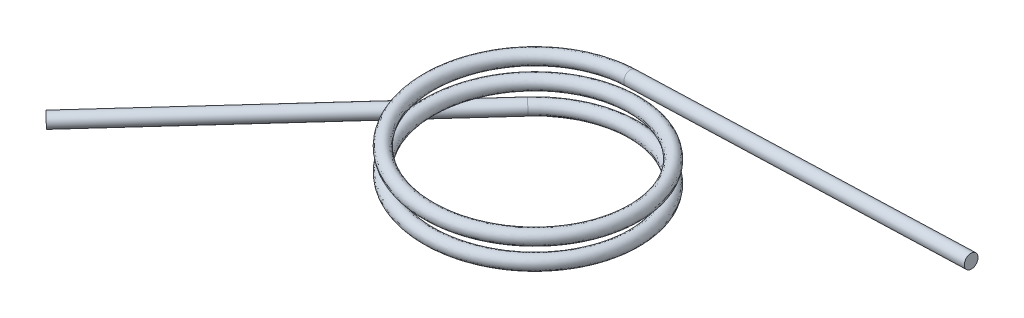
ISO-10303-21;
HEADER;
FILE_DESCRIPTION(('STEP AP214'),'2;1');
FILE_NAME('part.step','',(''),(''),'','','');
FILE_SCHEMA(('AUTOMOTIVE_DESIGN { 1 0 10303 214 1 1 1 1 }'));
ENDSEC;
DATA;
#1=APPLICATION_CONTEXT('core data for automotive mechanical design processes');
#2=APPLICATION_PROTOCOL_DEFINITION('international standard','automotive_design',2000,#1);
#3=PRODUCT_CONTEXT('',#1,'mechanical');
#4=PRODUCT('Part','Part','',(#3));
#5=PRODUCT_RELATED_PRODUCT_CATEGORY('part','',(#4));
#6=PRODUCT_DEFINITION_FORMATION('','',#4);
#7=PRODUCT_DEFINITION_CONTEXT('part definition',#1,'design');
#8=PRODUCT_DEFINITION('design','',#6,#7);
#9=PRODUCT_DEFINITION_SHAPE('','',#8);
#10=(LENGTH_UNIT() NAMED_UNIT(*) SI_UNIT(.MILLI.,.METRE.));
#11=(NAMED_UNIT(*) PLANE_ANGLE_UNIT() SI_UNIT($,.RADIAN.));
#12=(NAMED_UNIT(*) SI_UNIT($,.STERADIAN.) SOLID_ANGLE_UNIT());
#13=UNCERTAINTY_MEASURE_WITH_UNIT(LENGTH_MEASURE(1.E-05),#10,'distance_accuracy_value','');
#14=(GEOMETRIC_REPRESENTATION_CONTEXT(3) GLOBAL_UNCERTAINTY_ASSIGNED_CONTEXT((#13)) GLOBAL_UNIT_ASSIGNED_CONTEXT((#10,
#11,#12)) REPRESENTATION_CONTEXT('',''));
#15=CARTESIAN_POINT('',(0.,0.,0.));
#16=DIRECTION('',(0.,0.,1.));
#17=DIRECTION('',(1.,0.,0.));
#18=AXIS2_PLACEMENT_3D('',#15,#16,#17);
#19=CARTESIAN_POINT('',(0.0683991630659008,-2.03084848142146,-30.607));
#20=CARTESIAN_POINT('',(-6.91744885759342,-2.26216990999289,-30.6226116626235));
#21=CARTESIAN_POINT('',(-13.2182540866581,-2.49349133856432,-27.6056314245129));
#22=CARTESIAN_POINT('',(-19.5190593157229,-2.72481276713575,-24.5886511864022));
#23=CARTESIAN_POINT('',(-23.8868700032717,-2.95613419570717,-19.1366289845496));
#24=CARTESIAN_POINT('',(-28.2546806908206,-3.1874556242786,-13.6846067826971));
#25=CARTESIAN_POINT('',(-29.8243983625018,-3.41877705285003,-6.87738247884374));
#26=CARTESIAN_POINT('',(-31.3941160341831,-3.65009848142146,-0.0701581749904256));
#27=CARTESIAN_POINT('',(-29.8548388537963,-3.88141990999289,6.74401397235809));
#28=CARTESIAN_POINT('',(-28.3155616734096,-4.11274133856432,13.5581861197066));
#29=CARTESIAN_POINT('',(-23.9721623645263,-4.34406276713575,19.0296757464309));
#30=CARTESIAN_POINT('',(-19.6287630556429,-4.57538419570717,24.5011653731551));
#31=CARTESIAN_POINT('',(-13.3415051196841,-4.8067056242786,27.5462768552658));
#32=CARTESIAN_POINT('',(-7.05424718372522,-5.03802705285003,30.5913883373765));
#33=CARTESIAN_POINT('',(-0.0683991630659045,-5.26934848142146,30.607));
#34=CARTESIAN_POINT('',(6.91744885759342,-5.50066990999289,30.6226116626235));
#35=CARTESIAN_POINT('',(13.2182540866581,-5.73199133856432,27.6056314245129));
#36=CARTESIAN_POINT('',(19.5190593157229,-5.96331276713575,24.5886511864022));
#37=CARTESIAN_POINT('',(23.8868700032717,-6.19463419570718,19.1366289845497));
#38=CARTESIAN_POINT('',(28.2546806908206,-6.4259556242786,13.6846067826971));
#39=CARTESIAN_POINT('',(29.8243983625018,-6.65727705285003,6.87738247884374));
#40=CARTESIAN_POINT('',(31.3941160341831,-6.88859848142146,0.0701581749904294));
#41=CARTESIAN_POINT('',(29.8548388537963,-7.11991990999289,-6.74401397235809));
#42=CARTESIAN_POINT('',(28.3155616734096,-7.35124133856432,-13.5581861197066));
#43=CARTESIAN_POINT('',(23.9721623645263,-7.58256276713575,-19.0296757464309));
#44=CARTESIAN_POINT('',(19.6287630556429,-7.81388419570717,-24.5011653731551));
#45=CARTESIAN_POINT('',(13.3415051196841,-8.0452056242786,-27.5462768552658));
#46=CARTESIAN_POINT('',(7.05424718372523,-8.27652705285003,-30.5913883373765));
#47=CARTESIAN_POINT('',(0.0683991630659008,-8.50784848142146,-30.607));
#48=CARTESIAN_POINT('',(-6.91744885759342,-8.73916990999289,-30.6226116626235));
#49=CARTESIAN_POINT('',(-13.2182540866581,-8.97049133856432,-27.6056314245129));
#50=CARTESIAN_POINT('',(-19.5190593157229,-9.20181276713575,-24.5886511864022));
#51=CARTESIAN_POINT('',(-23.8868700032717,-9.43313419570718,-19.1366289845496));
#52=CARTESIAN_POINT('',(-28.2546806908206,-9.6644556242786,-13.6846067826971));
#53=CARTESIAN_POINT('',(-29.8243983625018,-9.89577705285003,-6.87738247884374));
#54=CARTESIAN_POINT('',(-31.3941160341831,-10.1270984814215,-0.0701581749904256));
#55=CARTESIAN_POINT('',(-29.8548388537963,-10.3584199099929,6.74401397235809));
#56=CARTESIAN_POINT('',(-28.3155616734096,-10.5897413385643,13.5581861197066));
#57=CARTESIAN_POINT('',(-23.9721623645263,-10.8210627671357,19.0296757464309));
#58=CARTESIAN_POINT('',(-19.6287630556429,-11.0523841957072,24.5011653731551));
#59=CARTESIAN_POINT('',(-13.3415051196841,-11.2837056242786,27.5462768552658));
#60=CARTESIAN_POINT('',(-7.05424718372522,-11.51502705285,30.5913883373765));
#61=CARTESIAN_POINT('',(-0.0683991630659045,-11.7463484814215,30.607));
#62=CARTESIAN_POINT('',(6.91744885759342,-11.9776699099929,30.6226116626235));
#63=CARTESIAN_POINT('',(13.2182540866581,-12.2089913385643,27.6056314245129));
#64=CARTESIAN_POINT('',(19.5190593157229,-12.4403127671357,24.5886511864022));
#65=CARTESIAN_POINT('',(23.8868700032717,-12.6716341957072,19.1366289845497));
#66=CARTESIAN_POINT('',(28.2546806908206,-12.9029556242786,13.6846067826971));
#67=CARTESIAN_POINT('',(29.8243983625018,-13.13427705285,6.87738247884374));
#68=CARTESIAN_POINT('',(31.3941160341831,-13.3655984814215,0.0701581749904294));
#69=CARTESIAN_POINT('',(29.8548388537963,-13.5969199099929,-6.74401397235809));
#70=CARTESIAN_POINT('',(28.3155616734096,-13.8282413385643,-13.5581861197066));
#71=CARTESIAN_POINT('',(23.9721623645263,-14.0595627671357,-19.0296757464309));
#72=CARTESIAN_POINT('',(19.6287630556429,-14.2908841957072,-24.5011653731551));
#73=CARTESIAN_POINT('',(13.3415051196841,-14.5222056242786,-27.5462768552658));
#74=CARTESIAN_POINT('',(7.05424718372523,-14.75352705285,-30.5913883373765));
#75=CARTESIAN_POINT('',(0.0683991630659008,-14.9848484814215,-30.607));
#76=CARTESIAN_POINT('',(-6.91744885759342,-15.2161699099929,-30.6226116626235));
#77=CARTESIAN_POINT('',(-13.2182540866581,-15.4474913385643,-27.6056314245129));
#78=CARTESIAN_POINT('',(-17.9086280696568,-15.6196890134387,-25.3597652055763));
#79=CARTESIAN_POINT('',(-21.5940342546356,-15.7952045007292,-21.6908001709281));
#80=CARTESIAN_POINT('',(0.0683991630659331,-2.03084848142146,-26.543));
#81=CARTESIAN_POINT('',(-5.98986737767182,-2.26216990999289,-26.5586116626236));
#82=CARTESIAN_POINT('',(-11.4549505708844,-2.49349133856432,-23.9440939453575));
#83=CARTESIAN_POINT('',(-16.9200337640969,-2.72481276713574,-21.3295762280914));
#84=CARTESIAN_POINT('',(-20.7095068585216,-2.95613419570717,-16.6027664297958));
#85=CARTESIAN_POINT('',(-24.4989799529464,-3.1874556242786,-11.8759566315002));
#86=CARTESIAN_POINT('',(-25.8622913273949,-3.41877705285003,-5.97305740324531));
#87=CARTESIAN_POINT('',(-27.2256027018434,-3.65009848142146,-0.0701581749904585));
#88=CARTESIAN_POINT('',(-25.8927318186894,-3.88141990999289,5.8396888967596));
#89=CARTESIAN_POINT('',(-24.5598609355354,-4.11274133856432,11.7495359685097));
#90=CARTESIAN_POINT('',(-20.7947992197762,-4.34406276713574,16.495813191677));
#91=CARTESIAN_POINT('',(-17.029737504017,-4.57538419570717,21.2420904148443));
#92=CARTESIAN_POINT('',(-11.5782016039103,-4.8067056242786,23.8847393761104));
#93=CARTESIAN_POINT('',(-6.12666570380369,-5.03802705285003,26.5273883373765));
#94=CARTESIAN_POINT('',(-0.0683991630659364,-5.26934848142146,26.543));
#95=CARTESIAN_POINT('',(5.98986737767181,-5.50066990999289,26.5586116626236));
#96=CARTESIAN_POINT('',(11.4549505708844,-5.73199133856432,23.9440939453575));
#97=CARTESIAN_POINT('',(16.9200337640969,-5.96331276713574,21.3295762280914));
#98=CARTESIAN_POINT('',(20.7095068585216,-6.19463419570717,16.6027664297958));
#99=CARTESIAN_POINT('',(24.4989799529464,-6.4259556242786,11.8759566315002));
#100=CARTESIAN_POINT('',(25.8622913273949,-6.65727705285003,5.97305740324531));
#101=CARTESIAN_POINT('',(27.2256027018434,-6.88859848142146,0.0701581749904618));
#102=CARTESIAN_POINT('',(25.8927318186894,-7.11991990999289,-5.83968889675959));
#103=CARTESIAN_POINT('',(24.5598609355354,-7.35124133856432,-11.7495359685097));
#104=CARTESIAN_POINT('',(20.7947992197762,-7.58256276713575,-16.495813191677));
#105=CARTESIAN_POINT('',(17.029737504017,-7.81388419570717,-21.2420904148443));
#106=CARTESIAN_POINT('',(11.5782016039103,-8.0452056242786,-23.8847393761104));
#107=CARTESIAN_POINT('',(6.12666570380369,-8.27652705285003,-26.5273883373765));
#108=CARTESIAN_POINT('',(0.0683991630659331,-8.50784848142146,-26.543));
#109=CARTESIAN_POINT('',(-5.98986737767182,-8.73916990999289,-26.5586116626236));
#110=CARTESIAN_POINT('',(-11.4549505708844,-8.97049133856432,-23.9440939453575));
#111=CARTESIAN_POINT('',(-16.9200337640969,-9.20181276713574,-21.3295762280914));
#112=CARTESIAN_POINT('',(-20.7095068585216,-9.43313419570717,-16.6027664297958));
#113=CARTESIAN_POINT('',(-24.4989799529464,-9.6644556242786,-11.8759566315002));
#114=CARTESIAN_POINT('',(-25.8622913273949,-9.89577705285003,-5.97305740324531));
#115=CARTESIAN_POINT('',(-27.2256027018434,-10.1270984814215,-0.0701581749904585));
#116=CARTESIAN_POINT('',(-25.8927318186894,-10.3584199099929,5.8396888967596));
#117=CARTESIAN_POINT('',(-24.5598609355354,-10.5897413385643,11.7495359685097));
#118=CARTESIAN_POINT('',(-20.7947992197762,-10.8210627671357,16.495813191677));
#119=CARTESIAN_POINT('',(-17.029737504017,-11.0523841957072,21.2420904148443));
#120=CARTESIAN_POINT('',(-11.5782016039103,-11.2837056242786,23.8847393761104));
#121=CARTESIAN_POINT('',(-6.12666570380369,-11.51502705285,26.5273883373765));
#122=CARTESIAN_POINT('',(-0.0683991630659364,-11.7463484814215,26.543));
#123=CARTESIAN_POINT('',(5.98986737767181,-11.9776699099929,26.5586116626236));
#124=CARTESIAN_POINT('',(11.4549505708844,-12.2089913385643,23.9440939453575));
#125=CARTESIAN_POINT('',(16.9200337640969,-12.4403127671357,21.3295762280914));
#126=CARTESIAN_POINT('',(20.7095068585216,-12.6716341957072,16.6027664297958));
#127=CARTESIAN_POINT('',(24.4989799529464,-12.9029556242786,11.8759566315002));
#128=CARTESIAN_POINT('',(25.8622913273949,-13.13427705285,5.97305740324531));
#129=CARTESIAN_POINT('',(27.2256027018434,-13.3655984814215,0.0701581749904618));
#130=CARTESIAN_POINT('',(25.8927318186894,-13.5969199099929,-5.83968889675959));
#131=CARTESIAN_POINT('',(24.5598609355354,-13.8282413385643,-11.7495359685097));
#132=CARTESIAN_POINT('',(20.7947992197762,-14.0595627671357,-16.495813191677));
#133=CARTESIAN_POINT('',(17.029737504017,-14.2908841957072,-21.2420904148443));
#134=CARTESIAN_POINT('',(11.5782016039103,-14.5222056242786,-23.8847393761104));
#135=CARTESIAN_POINT('',(6.12666570380369,-14.75352705285,-26.5273883373765));
#136=CARTESIAN_POINT('',(0.0683991630659331,-14.9848484814215,-26.543));
#137=CARTESIAN_POINT('',(-5.98986737767182,-15.2161699099929,-26.5586116626236));
#138=CARTESIAN_POINT('',(-11.4549505708844,-15.4474913385643,-23.9440939453575));
#139=CARTESIAN_POINT('',(-15.5232058323111,-15.6196890134387,-21.997824312615));
#140=CARTESIAN_POINT('',(-18.720354612391,-15.7952045007292,-18.8171158956903));
#141=CARTESIAN_POINT('',(-0.0683991630662958,2.03084848142146,-26.543));
#142=CARTESIAN_POINT('',(-6.12666570380405,1.79952705285003,-26.5273883373764));
#143=CARTESIAN_POINT('',(-11.5782016039107,1.5682056242786,-23.8847393761102));
#144=CARTESIAN_POINT('',(-17.0297375040173,1.33688419570718,-21.242090414844));
#145=CARTESIAN_POINT('',(-20.7947992197764,1.10556276713575,-16.4958131916767));
#146=CARTESIAN_POINT('',(-24.5598609355356,0.874241338564318,-11.7495359685093));
#147=CARTESIAN_POINT('',(-25.8927318186895,0.64291990999289,-5.83968889675925));
#148=CARTESIAN_POINT('',(-27.2256027018434,0.411598481421461,0.0701581749908272));
#149=CARTESIAN_POINT('',(-25.8622913273948,0.180277052850032,5.97305740324566));
#150=CARTESIAN_POINT('',(-24.4989799529462,-0.0510443757213964,11.8759566315005));
#151=CARTESIAN_POINT('',(-20.7095068585214,-0.282365804292825,16.6027664297961));
#152=CARTESIAN_POINT('',(-16.9200337640966,-0.513687232864254,21.3295762280916));
#153=CARTESIAN_POINT('',(-11.454950570884,-0.745008661435682,23.9440939453576));
#154=CARTESIAN_POINT('',(-5.98986737767146,-0.976330090007111,26.5586116626236));
#155=CARTESIAN_POINT('',(0.0683991630662926,-1.20765151857854,26.543));
#156=CARTESIAN_POINT('',(6.12666570380404,-1.43897294714997,26.5273883373764));
#157=CARTESIAN_POINT('',(11.5782016039107,-1.6702943757214,23.8847393761102));
#158=CARTESIAN_POINT('',(17.0297375040173,-1.90161580429283,21.242090414844));
#159=CARTESIAN_POINT('',(20.7947992197764,-2.13293723286425,16.4958131916767));
#160=CARTESIAN_POINT('',(24.5598609355356,-2.36425866143568,11.7495359685093));
#161=CARTESIAN_POINT('',(25.8927318186895,-2.59558009000711,5.83968889675925));
#162=CARTESIAN_POINT('',(27.2256027018434,-2.82690151857854,-0.0701581749908239));
#163=CARTESIAN_POINT('',(25.8622913273948,-3.05822294714997,-5.97305740324566));
#164=CARTESIAN_POINT('',(24.4989799529462,-3.2895443757214,-11.8759566315005));
#165=CARTESIAN_POINT('',(20.7095068585214,-3.52086580429282,-16.6027664297961));
#166=CARTESIAN_POINT('',(16.9200337640966,-3.75218723286425,-21.3295762280916));
#167=CARTESIAN_POINT('',(11.454950570884,-3.98350866143568,-23.9440939453576));
#168=CARTESIAN_POINT('',(5.98986737767146,-4.21483009000711,-26.5586116626236));
#169=CARTESIAN_POINT('',(-0.0683991630662958,-4.44615151857854,-26.543));
#170=CARTESIAN_POINT('',(-6.12666570380405,-4.67747294714997,-26.5273883373764));
#171=CARTESIAN_POINT('',(-11.5782016039107,-4.9087943757214,-23.8847393761102));
#172=CARTESIAN_POINT('',(-17.0297375040173,-5.14011580429282,-21.242090414844));
#173=CARTESIAN_POINT('',(-20.7947992197764,-5.37143723286425,-16.4958131916767));
#174=CARTESIAN_POINT('',(-24.5598609355356,-5.60275866143568,-11.7495359685093));
#175=CARTESIAN_POINT('',(-25.8927318186895,-5.83408009000711,-5.83968889675925));
#176=CARTESIAN_POINT('',(-27.2256027018434,-6.06540151857854,0.0701581749908272));
#177=CARTESIAN_POINT('',(-25.8622913273948,-6.29672294714997,5.97305740324566));
#178=CARTESIAN_POINT('',(-24.4989799529462,-6.5280443757214,11.8759566315005));
#179=CARTESIAN_POINT('',(-20.7095068585214,-6.75936580429283,16.6027664297961));
#180=CARTESIAN_POINT('',(-16.9200337640966,-6.99068723286425,21.3295762280916));
#181=CARTESIAN_POINT('',(-11.454950570884,-7.22200866143568,23.9440939453576));
#182=CARTESIAN_POINT('',(-5.98986737767146,-7.45333009000711,26.5586116626236));
#183=CARTESIAN_POINT('',(0.0683991630662926,-7.68465151857854,26.543));
#184=CARTESIAN_POINT('',(6.12666570380404,-7.91597294714997,26.5273883373764));
#185=CARTESIAN_POINT('',(11.5782016039107,-8.1472943757214,23.8847393761102));
#186=CARTESIAN_POINT('',(17.0297375040173,-8.37861580429283,21.242090414844));
#187=CARTESIAN_POINT('',(20.7947992197764,-8.60993723286425,16.4958131916767));
#188=CARTESIAN_POINT('',(24.5598609355356,-8.84125866143568,11.7495359685093));
#189=CARTESIAN_POINT('',(25.8927318186895,-9.07258009000711,5.83968889675925));
#190=CARTESIAN_POINT('',(27.2256027018434,-9.30390151857854,-0.0701581749908239));
#191=CARTESIAN_POINT('',(25.8622913273948,-9.53522294714997,-5.97305740324566));
#192=CARTESIAN_POINT('',(24.4989799529462,-9.7665443757214,-11.8759566315005));
#193=CARTESIAN_POINT('',(20.7095068585214,-9.99786580429283,-16.6027664297961));
#194=CARTESIAN_POINT('',(16.9200337640966,-10.2291872328643,-21.3295762280916));
#195=CARTESIAN_POINT('',(11.454950570884,-10.4605086614357,-23.9440939453576));
#196=CARTESIAN_POINT('',(5.98986737767146,-10.6918300900071,-26.5586116626236));
#197=CARTESIAN_POINT('',(-0.0683991630662958,-10.9231515185785,-26.543));
#198=CARTESIAN_POINT('',(-6.12666570380405,-11.15447294715,-26.5273883373764));
#199=CARTESIAN_POINT('',(-11.5782016039107,-11.3857943757214,-23.8847393761102));
#200=CARTESIAN_POINT('',(-15.6363721430179,-11.5579920505958,-21.9175286016928));
#201=CARTESIAN_POINT('',(-18.8170857144296,-11.7335075378863,-18.7203849496029));
#202=CARTESIAN_POINT('',(-0.0683991630663282,2.03084848142146,-30.607));
#203=CARTESIAN_POINT('',(-7.05424718372565,1.79952705285003,-30.5913883373764));
#204=CARTESIAN_POINT('',(-13.3415051196844,1.5682056242786,-27.5462768552656));
#205=CARTESIAN_POINT('',(-19.6287630556432,1.33688419570717,-24.5011653731549));
#206=CARTESIAN_POINT('',(-23.9721623645265,1.10556276713575,-19.0296757464305));
#207=CARTESIAN_POINT('',(-28.3155616734098,0.874241338564318,-13.5581861197062));
#208=CARTESIAN_POINT('',(-29.8548388537964,0.642919909992889,-6.74401397235768));
#209=CARTESIAN_POINT('',(-31.3941160341831,0.41159848142146,0.0701581749908602));
#210=CARTESIAN_POINT('',(-29.8243983625017,0.180277052850032,6.87738247884415));
#211=CARTESIAN_POINT('',(-28.2546806908204,-0.0510443757213968,13.6846067826974));
#212=CARTESIAN_POINT('',(-23.8868700032715,-0.282365804292825,19.13662898455));
#213=CARTESIAN_POINT('',(-19.5190593157225,-0.513687232864254,24.5886511864025));
#214=CARTESIAN_POINT('',(-13.2182540866578,-0.745008661435682,27.6056314245131));
#215=CARTESIAN_POINT('',(-6.91744885759299,-0.976330090007111,30.6226116626236));
#216=CARTESIAN_POINT('',(0.0683991630663244,-1.20765151857854,30.607));
#217=CARTESIAN_POINT('',(7.05424718372564,-1.43897294714997,30.5913883373764));
#218=CARTESIAN_POINT('',(13.3415051196844,-1.6702943757214,27.5462768552656));
#219=CARTESIAN_POINT('',(19.6287630556432,-1.90161580429283,24.5011653731549));
#220=CARTESIAN_POINT('',(23.9721623645265,-2.13293723286425,19.0296757464305));
#221=CARTESIAN_POINT('',(28.3155616734098,-2.36425866143568,13.5581861197062));
#222=CARTESIAN_POINT('',(29.8548388537964,-2.59558009000711,6.74401397235768));
#223=CARTESIAN_POINT('',(31.3941160341831,-2.82690151857854,-0.0701581749908563));
#224=CARTESIAN_POINT('',(29.8243983625017,-3.05822294714997,-6.87738247884415));
#225=CARTESIAN_POINT('',(28.2546806908204,-3.2895443757214,-13.6846067826974));
#226=CARTESIAN_POINT('',(23.8868700032715,-3.52086580429283,-19.13662898455));
#227=CARTESIAN_POINT('',(19.5190593157225,-3.75218723286425,-24.5886511864025));
#228=CARTESIAN_POINT('',(13.2182540866578,-3.98350866143568,-27.6056314245131));
#229=CARTESIAN_POINT('',(6.917448857593,-4.21483009000711,-30.6226116626236));
#230=CARTESIAN_POINT('',(-0.0683991630663282,-4.44615151857854,-30.607));
#231=CARTESIAN_POINT('',(-7.05424718372565,-4.67747294714997,-30.5913883373764));
#232=CARTESIAN_POINT('',(-13.3415051196844,-4.9087943757214,-27.5462768552656));
#233=CARTESIAN_POINT('',(-19.6287630556432,-5.14011580429283,-24.5011653731549));
#234=CARTESIAN_POINT('',(-23.9721623645265,-5.37143723286425,-19.0296757464305));
#235=CARTESIAN_POINT('',(-28.3155616734098,-5.60275866143568,-13.5581861197062));
#236=CARTESIAN_POINT('',(-29.8548388537964,-5.83408009000711,-6.74401397235768));
#237=CARTESIAN_POINT('',(-31.3941160341831,-6.06540151857854,0.0701581749908602));
#238=CARTESIAN_POINT('',(-29.8243983625017,-6.29672294714997,6.87738247884415));
#239=CARTESIAN_POINT('',(-28.2546806908204,-6.5280443757214,13.6846067826974));
#240=CARTESIAN_POINT('',(-23.8868700032715,-6.75936580429283,19.13662898455));
#241=CARTESIAN_POINT('',(-19.5190593157225,-6.99068723286425,24.5886511864025));
#242=CARTESIAN_POINT('',(-13.2182540866578,-7.22200866143568,27.6056314245131));
#243=CARTESIAN_POINT('',(-6.91744885759299,-7.45333009000711,30.6226116626236));
#244=CARTESIAN_POINT('',(0.0683991630663244,-7.68465151857854,30.607));
#245=CARTESIAN_POINT('',(7.05424718372564,-7.91597294714997,30.5913883373764));
#246=CARTESIAN_POINT('',(13.3415051196844,-8.1472943757214,27.5462768552656));
#247=CARTESIAN_POINT('',(19.6287630556432,-8.37861580429283,24.5011653731549));
#248=CARTESIAN_POINT('',(23.9721623645265,-8.60993723286426,19.0296757464305));
#249=CARTESIAN_POINT('',(28.3155616734098,-8.84125866143568,13.5581861197062));
#250=CARTESIAN_POINT('',(29.8548388537964,-9.07258009000711,6.74401397235768));
#251=CARTESIAN_POINT('',(31.3941160341831,-9.30390151857854,-0.0701581749908563));
#252=CARTESIAN_POINT('',(29.8243983625017,-9.53522294714997,-6.87738247884415));
#253=CARTESIAN_POINT('',(28.2546806908204,-9.7665443757214,-13.6846067826974));
#254=CARTESIAN_POINT('',(23.8868700032715,-9.99786580429283,-19.13662898455));
#255=CARTESIAN_POINT('',(19.5190593157225,-10.2291872328643,-24.5886511864025));
#256=CARTESIAN_POINT('',(13.2182540866578,-10.4605086614357,-27.6056314245131));
#257=CARTESIAN_POINT('',(6.917448857593,-10.6918300900071,-30.6226116626236));
#258=CARTESIAN_POINT('',(-0.0683991630663282,-10.9231515185785,-30.607));
#259=CARTESIAN_POINT('',(-7.05424718372565,-11.15447294715,-30.5913883373764));
#260=CARTESIAN_POINT('',(-13.3415051196844,-11.3857943757214,-27.5462768552656));
#261=CARTESIAN_POINT('',(-18.0217943803637,-11.5579920505958,-25.2794694946542));
#262=CARTESIAN_POINT('',(-21.6907653566742,-11.7335075378863,-21.5940692248406));
#263=CARTESIAN_POINT('',(-0.0683991630663606,2.03084848142146,-34.671));
#264=CARTESIAN_POINT('',(-7.98182866364725,1.79952705285003,-34.6553883373764));
#265=CARTESIAN_POINT('',(-15.1048086354582,1.5682056242786,-31.207814334421));
#266=CARTESIAN_POINT('',(-22.2277886072692,1.33688419570717,-27.7602403314657));
#267=CARTESIAN_POINT('',(-27.1495255092766,1.10556276713575,-21.5635383011844));
#268=CARTESIAN_POINT('',(-32.071262411284,0.874241338564317,-15.3668362709031));
#269=CARTESIAN_POINT('',(-33.8169458889034,0.642919909992889,-7.64833904795611));
#270=CARTESIAN_POINT('',(-35.5626293665227,0.41159848142146,0.0701581749908931));
#271=CARTESIAN_POINT('',(-33.7865053976087,0.180277052850031,7.78170755444265));
#272=CARTESIAN_POINT('',(-32.0103814286946,-0.0510443757213972,15.4932569338944));
#273=CARTESIAN_POINT('',(-27.0642331480215,-0.282365804292826,21.6704915393039));
#274=CARTESIAN_POINT('',(-22.1180848673484,-0.513687232864254,27.8477261447134));
#275=CARTESIAN_POINT('',(-14.9815576024315,-0.745008661435683,31.2671689036685));
#276=CARTESIAN_POINT('',(-7.84503033751453,-0.976330090007112,34.6866116626236));
#277=CARTESIAN_POINT('',(0.0683991630663563,-1.20765151857854,34.671));
#278=CARTESIAN_POINT('',(7.98182866364724,-1.43897294714997,34.6553883373764));
#279=CARTESIAN_POINT('',(15.1048086354582,-1.6702943757214,31.207814334421));
#280=CARTESIAN_POINT('',(22.2277886072692,-1.90161580429283,27.7602403314657));
#281=CARTESIAN_POINT('',(27.1495255092766,-2.13293723286425,21.5635383011844));
#282=CARTESIAN_POINT('',(32.071262411284,-2.36425866143568,15.3668362709031));
#283=CARTESIAN_POINT('',(33.8169458889034,-2.59558009000711,7.64833904795611));
#284=CARTESIAN_POINT('',(35.5626293665227,-2.82690151857854,-0.0701581749908887));
#285=CARTESIAN_POINT('',(33.7865053976087,-3.05822294714997,-7.78170755444264));
#286=CARTESIAN_POINT('',(32.0103814286946,-3.2895443757214,-15.4932569338944));
#287=CARTESIAN_POINT('',(27.0642331480215,-3.52086580429283,-21.6704915393039));
#288=CARTESIAN_POINT('',(22.1180848673485,-3.75218723286425,-27.8477261447134));
#289=CARTESIAN_POINT('',(14.9815576024315,-3.98350866143568,-31.2671689036685));
#290=CARTESIAN_POINT('',(7.84503033751454,-4.21483009000711,-34.6866116626236));
#291=CARTESIAN_POINT('',(-0.0683991630663606,-4.44615151857854,-34.671));
#292=CARTESIAN_POINT('',(-7.98182866364725,-4.67747294714997,-34.6553883373764));
#293=CARTESIAN_POINT('',(-15.1048086354582,-4.9087943757214,-31.207814334421));
#294=CARTESIAN_POINT('',(-22.2277886072692,-5.14011580429283,-27.7602403314657));
#295=CARTESIAN_POINT('',(-27.1495255092766,-5.37143723286425,-21.5635383011844));
#296=CARTESIAN_POINT('',(-32.071262411284,-5.60275866143568,-15.3668362709031));
#297=CARTESIAN_POINT('',(-33.8169458889034,-5.83408009000711,-7.64833904795611));
#298=CARTESIAN_POINT('',(-35.5626293665227,-6.06540151857854,0.0701581749908931));
#299=CARTESIAN_POINT('',(-33.7865053976087,-6.29672294714997,7.78170755444265));
#300=CARTESIAN_POINT('',(-32.0103814286946,-6.5280443757214,15.4932569338944));
#301=CARTESIAN_POINT('',(-27.0642331480215,-6.75936580429283,21.6704915393039));
#302=CARTESIAN_POINT('',(-22.1180848673484,-6.99068723286425,27.8477261447134));
#303=CARTESIAN_POINT('',(-14.9815576024315,-7.22200866143568,31.2671689036685));
#304=CARTESIAN_POINT('',(-7.84503033751453,-7.45333009000711,34.6866116626236));
#305=CARTESIAN_POINT('',(0.0683991630663563,-7.68465151857854,34.671));
#306=CARTESIAN_POINT('',(7.98182866364724,-7.91597294714997,34.6553883373764));
#307=CARTESIAN_POINT('',(15.1048086354582,-8.1472943757214,31.207814334421));
#308=CARTESIAN_POINT('',(22.2277886072692,-8.37861580429283,27.7602403314657));
#309=CARTESIAN_POINT('',(27.1495255092766,-8.60993723286426,21.5635383011844));
#310=CARTESIAN_POINT('',(32.071262411284,-8.84125866143568,15.3668362709031));
#311=CARTESIAN_POINT('',(33.8169458889034,-9.07258009000711,7.64833904795611));
#312=CARTESIAN_POINT('',(35.5626293665227,-9.30390151857854,-0.0701581749908887));
#313=CARTESIAN_POINT('',(33.7865053976087,-9.53522294714997,-7.78170755444264));
#314=CARTESIAN_POINT('',(32.0103814286946,-9.7665443757214,-15.4932569338944));
#315=CARTESIAN_POINT('',(27.0642331480215,-9.99786580429283,-21.6704915393039));
#316=CARTESIAN_POINT('',(22.1180848673485,-10.2291872328643,-27.8477261447134));
#317=CARTESIAN_POINT('',(14.9815576024315,-10.4605086614357,-31.2671689036685));
#318=CARTESIAN_POINT('',(7.84503033751454,-10.6918300900071,-34.6866116626236));
#319=CARTESIAN_POINT('',(-0.0683991630663606,-10.9231515185785,-34.671));
#320=CARTESIAN_POINT('',(-7.98182866364725,-11.15447294715,-34.6553883373764));
#321=CARTESIAN_POINT('',(-15.1048086354582,-11.3857943757214,-31.207814334421));
#322=CARTESIAN_POINT('',(-20.4072166177094,-11.5579920505958,-28.6414103876156));
#323=CARTESIAN_POINT('',(-24.5644449989189,-11.7335075378863,-24.4677535000784));
#324=CARTESIAN_POINT('',(0.0683991630658684,-2.03084848142146,-34.671));
#325=CARTESIAN_POINT('',(-7.84503033751502,-2.26216990999289,-34.6866116626235));
#326=CARTESIAN_POINT('',(-14.9815576024319,-2.49349133856432,-31.2671689036683));
#327=CARTESIAN_POINT('',(-22.1180848673488,-2.72481276713575,-27.8477261447131));
#328=CARTESIAN_POINT('',(-27.0642331480218,-2.95613419570718,-21.6704915393035));
#329=CARTESIAN_POINT('',(-32.0103814286948,-3.1874556242786,-15.4932569338939));
#330=CARTESIAN_POINT('',(-33.7865053976088,-3.41877705285003,-7.78170755444217));
#331=CARTESIAN_POINT('',(-35.5626293665227,-3.65009848142146,-0.0701581749903926));
#332=CARTESIAN_POINT('',(-33.8169458889033,-3.88141990999289,7.64833904795658));
#333=CARTESIAN_POINT('',(-32.0712624112838,-4.11274133856432,15.3668362709036));
#334=CARTESIAN_POINT('',(-27.1495255092763,-4.34406276713575,21.5635383011848));
#335=CARTESIAN_POINT('',(-22.2277886072688,-4.57538419570718,27.760240331466));
#336=CARTESIAN_POINT('',(-15.1048086354578,-4.8067056242786,31.2078143344212));
#337=CARTESIAN_POINT('',(-7.98182866364676,-5.03802705285003,34.6553883373765));
#338=CARTESIAN_POINT('',(-0.0683991630658727,-5.26934848142146,34.671));
#339=CARTESIAN_POINT('',(7.84503033751502,-5.50066990999289,34.6866116626235));
#340=CARTESIAN_POINT('',(14.9815576024319,-5.73199133856432,31.2671689036683));
#341=CARTESIAN_POINT('',(22.1180848673488,-5.96331276713575,27.8477261447131));
#342=CARTESIAN_POINT('',(27.0642331480218,-6.19463419570718,21.6704915393035));
#343=CARTESIAN_POINT('',(32.0103814286948,-6.42595562427861,15.493256933894));
#344=CARTESIAN_POINT('',(33.7865053976088,-6.65727705285003,7.78170755444217));
#345=CARTESIAN_POINT('',(35.5626293665227,-6.88859848142146,0.070158174990397));
#346=CARTESIAN_POINT('',(33.8169458889033,-7.11991990999289,-7.64833904795658));
#347=CARTESIAN_POINT('',(32.0712624112838,-7.35124133856432,-15.3668362709036));
#348=CARTESIAN_POINT('',(27.1495255092763,-7.58256276713575,-21.5635383011848));
#349=CARTESIAN_POINT('',(22.2277886072688,-7.81388419570718,-27.760240331466));
#350=CARTESIAN_POINT('',(15.1048086354578,-8.0452056242786,-31.2078143344212));
#351=CARTESIAN_POINT('',(7.98182866364677,-8.27652705285003,-34.6553883373765));
#352=CARTESIAN_POINT('',(0.0683991630658684,-8.50784848142146,-34.671));
#353=CARTESIAN_POINT('',(-7.84503033751502,-8.73916990999289,-34.6866116626235));
#354=CARTESIAN_POINT('',(-14.9815576024319,-8.97049133856432,-31.2671689036683));
#355=CARTESIAN_POINT('',(-22.1180848673488,-9.20181276713575,-27.8477261447131));
#356=CARTESIAN_POINT('',(-27.0642331480218,-9.43313419570718,-21.6704915393035));
#357=CARTESIAN_POINT('',(-32.0103814286948,-9.66445562427861,-15.4932569338939));
#358=CARTESIAN_POINT('',(-33.7865053976088,-9.89577705285003,-7.78170755444217));
#359=CARTESIAN_POINT('',(-35.5626293665227,-10.1270984814215,-0.0701581749903926));
#360=CARTESIAN_POINT('',(-33.8169458889033,-10.3584199099929,7.64833904795658));
#361=CARTESIAN_POINT('',(-32.0712624112838,-10.5897413385643,15.3668362709036));
#362=CARTESIAN_POINT('',(-27.1495255092763,-10.8210627671357,21.5635383011848));
#363=CARTESIAN_POINT('',(-22.2277886072688,-11.0523841957072,27.760240331466));
#364=CARTESIAN_POINT('',(-15.1048086354578,-11.2837056242786,31.2078143344212));
#365=CARTESIAN_POINT('',(-7.98182866364676,-11.51502705285,34.6553883373765));
#366=CARTESIAN_POINT('',(-0.0683991630658727,-11.7463484814215,34.671));
#367=CARTESIAN_POINT('',(7.84503033751502,-11.9776699099929,34.6866116626235));
#368=CARTESIAN_POINT('',(14.9815576024319,-12.2089913385643,31.2671689036683));
#369=CARTESIAN_POINT('',(22.1180848673488,-12.4403127671357,27.8477261447131));
#370=CARTESIAN_POINT('',(27.0642331480218,-12.6716341957072,21.6704915393035));
#371=CARTESIAN_POINT('',(32.0103814286948,-12.9029556242786,15.493256933894));
#372=CARTESIAN_POINT('',(33.7865053976088,-13.13427705285,7.78170755444217));
#373=CARTESIAN_POINT('',(35.5626293665227,-13.3655984814215,0.070158174990397));
#374=CARTESIAN_POINT('',(33.8169458889033,-13.5969199099929,-7.64833904795658));
#375=CARTESIAN_POINT('',(32.0712624112838,-13.8282413385643,-15.3668362709036));
#376=CARTESIAN_POINT('',(27.1495255092763,-14.0595627671358,-21.5635383011848));
#377=CARTESIAN_POINT('',(22.2277886072688,-14.2908841957072,-27.760240331466));
#378=CARTESIAN_POINT('',(15.1048086354578,-14.5222056242786,-31.2078143344212));
#379=CARTESIAN_POINT('',(7.98182866364677,-14.75352705285,-34.6553883373765));
#380=CARTESIAN_POINT('',(0.0683991630658684,-14.9848484814215,-34.671));
#381=CARTESIAN_POINT('',(-7.84503033751502,-15.2161699099929,-34.6866116626235));
#382=CARTESIAN_POINT('',(-14.9815576024319,-15.4474913385643,-31.2671689036683));
#383=CARTESIAN_POINT('',(-20.2940503070026,-15.6196890134387,-28.7217060985377));
#384=CARTESIAN_POINT('',(-24.4677138968802,-15.7952045007292,-24.5644844461658));
#385=CARTESIAN_POINT('',(0.0683991630659008,-2.03084848142146,-30.607));
#386=CARTESIAN_POINT('',(-6.91744885759342,-2.26216990999289,-30.6226116626235));
#387=CARTESIAN_POINT('',(-13.2182540866581,-2.49349133856432,-27.6056314245129));
#388=CARTESIAN_POINT('',(-19.5190593157229,-2.72481276713575,-24.5886511864022));
#389=CARTESIAN_POINT('',(-23.8868700032717,-2.95613419570717,-19.1366289845496));
#390=CARTESIAN_POINT('',(-28.2546806908206,-3.1874556242786,-13.6846067826971));
#391=CARTESIAN_POINT('',(-29.8243983625018,-3.41877705285003,-6.87738247884374));
#392=CARTESIAN_POINT('',(-31.3941160341831,-3.65009848142146,-0.0701581749904256));
#393=CARTESIAN_POINT('',(-29.8548388537963,-3.88141990999289,6.74401397235809));
#394=CARTESIAN_POINT('',(-28.3155616734096,-4.11274133856432,13.5581861197066));
#395=CARTESIAN_POINT('',(-23.9721623645263,-4.34406276713575,19.0296757464309));
#396=CARTESIAN_POINT('',(-19.6287630556429,-4.57538419570717,24.5011653731551));
#397=CARTESIAN_POINT('',(-13.3415051196841,-4.8067056242786,27.5462768552658));
#398=CARTESIAN_POINT('',(-7.05424718372522,-5.03802705285003,30.5913883373765));
#399=CARTESIAN_POINT('',(-0.0683991630659045,-5.26934848142146,30.607));
#400=CARTESIAN_POINT('',(6.91744885759342,-5.50066990999289,30.6226116626235));
#401=CARTESIAN_POINT('',(13.2182540866581,-5.73199133856432,27.6056314245129));
#402=CARTESIAN_POINT('',(19.5190593157229,-5.96331276713575,24.5886511864022));
#403=CARTESIAN_POINT('',(23.8868700032717,-6.19463419570718,19.1366289845497));
#404=CARTESIAN_POINT('',(28.2546806908206,-6.4259556242786,13.6846067826971));
#405=CARTESIAN_POINT('',(29.8243983625018,-6.65727705285003,6.87738247884374));
#406=CARTESIAN_POINT('',(31.3941160341831,-6.88859848142146,0.0701581749904294));
#407=CARTESIAN_POINT('',(29.8548388537963,-7.11991990999289,-6.74401397235809));
#408=CARTESIAN_POINT('',(28.3155616734096,-7.35124133856432,-13.5581861197066));
#409=CARTESIAN_POINT('',(23.9721623645263,-7.58256276713575,-19.0296757464309));
#410=CARTESIAN_POINT('',(19.6287630556429,-7.81388419570717,-24.5011653731551));
#411=CARTESIAN_POINT('',(13.3415051196841,-8.0452056242786,-27.5462768552658));
#412=CARTESIAN_POINT('',(7.05424718372523,-8.27652705285003,-30.5913883373765));
#413=CARTESIAN_POINT('',(0.0683991630659008,-8.50784848142146,-30.607));
#414=CARTESIAN_POINT('',(-6.91744885759342,-8.73916990999289,-30.6226116626235));
#415=CARTESIAN_POINT('',(-13.2182540866581,-8.97049133856432,-27.6056314245129));
#416=CARTESIAN_POINT('',(-19.5190593157229,-9.20181276713575,-24.5886511864022));
#417=CARTESIAN_POINT('',(-23.8868700032717,-9.43313419570718,-19.1366289845496));
#418=CARTESIAN_POINT('',(-28.2546806908206,-9.6644556242786,-13.6846067826971));
#419=CARTESIAN_POINT('',(-29.8243983625018,-9.89577705285003,-6.87738247884374));
#420=CARTESIAN_POINT('',(-31.3941160341831,-10.1270984814215,-0.0701581749904256));
#421=CARTESIAN_POINT('',(-29.8548388537963,-10.3584199099929,6.74401397235809));
#422=CARTESIAN_POINT('',(-28.3155616734096,-10.5897413385643,13.5581861197066));
#423=CARTESIAN_POINT('',(-23.9721623645263,-10.8210627671357,19.0296757464309));
#424=CARTESIAN_POINT('',(-19.6287630556429,-11.0523841957072,24.5011653731551));
#425=CARTESIAN_POINT('',(-13.3415051196841,-11.2837056242786,27.5462768552658));
#426=CARTESIAN_POINT('',(-7.05424718372522,-11.51502705285,30.5913883373765));
#427=CARTESIAN_POINT('',(-0.0683991630659045,-11.7463484814215,30.607));
#428=CARTESIAN_POINT('',(6.91744885759342,-11.9776699099929,30.6226116626235));
#429=CARTESIAN_POINT('',(13.2182540866581,-12.2089913385643,27.6056314245129));
#430=CARTESIAN_POINT('',(19.5190593157229,-12.4403127671357,24.5886511864022));
#431=CARTESIAN_POINT('',(23.8868700032717,-12.6716341957072,19.1366289845497));
#432=CARTESIAN_POINT('',(28.2546806908206,-12.9029556242786,13.6846067826971));
#433=CARTESIAN_POINT('',(29.8243983625018,-13.13427705285,6.87738247884374));
#434=CARTESIAN_POINT('',(31.3941160341831,-13.3655984814215,0.0701581749904294));
#435=CARTESIAN_POINT('',(29.8548388537963,-13.5969199099929,-6.74401397235809));
#436=CARTESIAN_POINT('',(28.3155616734096,-13.8282413385643,-13.5581861197066));
#437=CARTESIAN_POINT('',(23.9721623645263,-14.0595627671357,-19.0296757464309));
#438=CARTESIAN_POINT('',(19.6287630556429,-14.2908841957072,-24.5011653731551));
#439=CARTESIAN_POINT('',(13.3415051196841,-14.5222056242786,-27.5462768552658));
#440=CARTESIAN_POINT('',(7.05424718372523,-14.75352705285,-30.5913883373765));
#441=CARTESIAN_POINT('',(0.0683991630659008,-14.9848484814215,-30.607));
#442=CARTESIAN_POINT('',(-6.91744885759342,-15.2161699099929,-30.6226116626235));
#443=CARTESIAN_POINT('',(-13.2182540866581,-15.4474913385643,-27.6056314245129));
#444=CARTESIAN_POINT('',(-17.9086280696568,-15.6196890134387,-25.3597652055763));
#445=CARTESIAN_POINT('',(-21.5940342546356,-15.7952045007292,-21.6908001709281));
#446=(BOUNDED_SURFACE() B_SPLINE_SURFACE(3,2,((#19,#20,#21,#22,#23,#24,#25,#26,#27,#28,#29,#30,
#31,#32,#33,#34,#35,#36,#37,#38,#39,#40,#41,#42,#43,#44,#45,#46,#47,#48,#49,#50,#51,#52,#53,#54,
#55,#56,#57,#58,#59,#60,#61,#62,#63,#64,#65,#66,#67,#68,#69,#70,#71,#72,#73,#74,#75,#76,#77,#78,
#79),(#80,#81,#82,#83,#84,#85,#86,#87,#88,#89,#90,#91,#92,#93,#94,#95,#96,#97,#98,#99,#100,#101,
#102,#103,#104,#105,#106,#107,#108,#109,#110,#111,#112,#113,#114,#115,#116,#117,#118,#119,#120,
#121,#122,#123,#124,#125,#126,#127,#128,#129,#130,#131,#132,#133,#134,#135,#136,#137,#138,#139,
#140),(#141,#142,#143,#144,#145,#146,#147,#148,#149,#150,#151,#152,#153,#154,#155,#156,#157,
#158,#159,#160,#161,#162,#163,#164,#165,#166,#167,#168,#169,#170,#171,#172,#173,#174,#175,#176,
#177,#178,#179,#180,#181,#182,#183,#184,#185,#186,#187,#188,#189,#190,#191,#192,#193,#194,#195,
#196,#197,#198,#199,#200,#201),(#202,#203,#204,#205,#206,#207,#208,#209,#210,#211,#212,#213,
#214,#215,#216,#217,#218,#219,#220,#221,#222,#223,#224,#225,#226,#227,#228,#229,#230,#231,#232,
#233,#234,#235,#236,#237,#238,#239,#240,#241,#242,#243,#244,#245,#246,#247,#248,#249,#250,#251,
#252,#253,#254,#255,#256,#257,#258,#259,#260,#261,#262),(#263,#264,#265,#266,#267,#268,#269,
#270,#271,#272,#273,#274,#275,#276,#277,#278,#279,#280,#281,#282,#283,#284,#285,#286,#287,#288,
#289,#290,#291,#292,#293,#294,#295,#296,#297,#298,#299,#300,#301,#302,#303,#304,#305,#306,#307,
#308,#309,#310,#311,#312,#313,#314,#315,#316,#317,#318,#319,#320,#321,#322,#323),(#324,#325,
#326,#327,#328,#329,#330,#331,#332,#333,#334,#335,#336,#337,#338,#339,#340,#341,#342,#343,#344,
#345,#346,#347,#348,#349,#350,#351,#352,#353,#354,#355,#356,#357,#358,#359,#360,#361,#362,#363,
#364,#365,#366,#367,#368,#369,#370,#371,#372,#373,#374,#375,#376,#377,#378,#379,#380,#381,#382,
#383,#384),(#385,#386,#387,#388,#389,#390,#391,#392,#393,#394,#395,#396,#397,#398,#399,#400,
#401,#402,#403,#404,#405,#406,#407,#408,#409,#410,#411,#412,#413,#414,#415,#416,#417,#418,#419,
#420,#421,#422,#423,#424,#425,#426,#427,#428,#429,#430,#431,#432,#433,#434,#435,#436,#437,#438,
#439,#440,#441,#442,#443,#444,#445)),.UNSPECIFIED.,.T.,.F.,.F.) B_SPLINE_SURFACE_WITH_KNOTS((4,
3,4),(3,2,2,2,2,2,2,2,2,2,2,2,2,2,2,2,2,2,2,2,2,2,2,2,2,2,2,2,2,2,3),(0.,0.5,1.),(0.,
0.0238095238095238,0.0476190476190476,0.0714285714285714,0.0952380952380952,0.119047619047619,
0.142857142857143,0.166666666666667,0.19047619047619,0.214285714285714,0.238095238095238,
0.261904761904762,0.285714285714286,0.30952380952381,0.333333333333333,0.357142857142857,
0.380952380952381,0.404761904761905,0.428571428571429,0.452380952380952,0.476190476190476,0.5,
0.523809523809524,0.547619047619048,0.571428571428571,0.595238095238095,0.619047619047619,
0.642857142857143,0.666666666666667,0.69047619047619,0.708314517932932),
.UNSPECIFIED.) GEOMETRIC_REPRESENTATION_ITEM() RATIONAL_B_SPLINE_SURFACE(((1.,0.974927912181824,
1.,0.974927912181824,1.,0.974927912181824,1.,0.974927912181824,1.,0.974927912181824,1.,
0.974927912181824,1.,0.974927912181824,1.,0.974927912181824,1.,0.974927912181824,1.,
0.974927912181824,1.,0.974927912181824,1.,0.974927912181824,1.,0.974927912181824,1.,
0.974927912181824,1.,0.974927912181824,1.,0.974927912181824,1.,0.974927912181824,1.,
0.974927912181824,1.,0.974927912181824,1.,0.974927912181824,1.,0.974927912181824,1.,
0.974927912181824,1.,0.974927912181824,1.,0.974927912181824,1.,0.974927912181824,1.,
0.974927912181824,1.,0.974927912181824,1.,0.974927912181824,1.,0.974927912181824,1.,
0.981215747273958,0.990578185245132),(0.333333333333333,0.324975970727275,0.333333333333333,
0.324975970727275,0.333333333333333,0.324975970727275,0.333333333333333,0.324975970727275,
0.333333333333333,0.324975970727275,0.333333333333333,0.324975970727275,0.333333333333333,
0.324975970727275,0.333333333333333,0.324975970727275,0.333333333333333,0.324975970727275,
0.333333333333333,0.324975970727275,0.333333333333333,0.324975970727275,0.333333333333333,
0.324975970727275,0.333333333333333,0.324975970727275,0.333333333333333,0.324975970727275,
0.333333333333333,0.324975970727275,0.333333333333333,0.324975970727275,0.333333333333333,
0.324975970727275,0.333333333333333,0.324975970727275,0.333333333333333,0.324975970727275,
0.333333333333333,0.324975970727275,0.333333333333333,0.324975970727275,0.333333333333333,
0.324975970727275,0.333333333333333,0.324975970727275,0.333333333333333,0.324975970727275,
0.333333333333333,0.324975970727275,0.333333333333333,0.324975970727275,0.333333333333333,
0.324975970727275,0.333333333333333,0.324975970727275,0.333333333333333,0.324975970727275,
0.333333333333333,0.327071915757986,0.330192728415044),(0.333333333333333,0.324975970727275,
0.333333333333333,0.324975970727275,0.333333333333333,0.324975970727275,0.333333333333333,
0.324975970727275,0.333333333333333,0.324975970727275,0.333333333333333,0.324975970727275,
0.333333333333333,0.324975970727275,0.333333333333333,0.324975970727275,0.333333333333333,
0.324975970727275,0.333333333333333,0.324975970727275,0.333333333333333,0.324975970727275,
0.333333333333333,0.324975970727275,0.333333333333333,0.324975970727275,0.333333333333333,
0.324975970727275,0.333333333333333,0.324975970727275,0.333333333333333,0.324975970727275,
0.333333333333333,0.324975970727275,0.333333333333333,0.324975970727275,0.333333333333333,
0.324975970727275,0.333333333333333,0.324975970727275,0.333333333333333,0.324975970727275,
0.333333333333333,0.324975970727275,0.333333333333333,0.324975970727275,0.333333333333333,
0.324975970727275,0.333333333333333,0.324975970727275,0.333333333333333,0.324975970727275,
0.333333333333333,0.324975970727275,0.333333333333333,0.324975970727275,0.333333333333333,
0.324975970727275,0.333333333333333,0.327071915757986,0.330192728415044),(1.,0.974927912181824,
1.,0.974927912181824,1.,0.974927912181824,1.,0.974927912181824,1.,0.974927912181824,1.,
0.974927912181824,1.,0.974927912181824,1.,0.974927912181824,1.,0.974927912181824,1.,
0.974927912181824,1.,0.974927912181824,1.,0.974927912181824,1.,0.974927912181824,1.,
0.974927912181824,1.,0.974927912181824,1.,0.974927912181824,1.,0.974927912181824,1.,
0.974927912181824,1.,0.974927912181824,1.,0.974927912181824,1.,0.974927912181824,1.,
0.974927912181824,1.,0.974927912181824,1.,0.974927912181824,1.,0.974927912181824,1.,
0.974927912181824,1.,0.974927912181824,1.,0.974927912181824,1.,0.974927912181824,1.,
0.981215747273958,0.990578185245132),(0.333333333333333,0.324975970727275,0.333333333333333,
0.324975970727275,0.333333333333333,0.324975970727275,0.333333333333333,0.324975970727275,
0.333333333333333,0.324975970727275,0.333333333333333,0.324975970727275,0.333333333333333,
0.324975970727275,0.333333333333333,0.324975970727275,0.333333333333333,0.324975970727275,
0.333333333333333,0.324975970727275,0.333333333333333,0.324975970727275,0.333333333333333,
0.324975970727275,0.333333333333333,0.324975970727275,0.333333333333333,0.324975970727275,
0.333333333333333,0.324975970727275,0.333333333333333,0.324975970727275,0.333333333333333,
0.324975970727275,0.333333333333333,0.324975970727275,0.333333333333333,0.324975970727275,
0.333333333333333,0.324975970727275,0.333333333333333,0.324975970727275,0.333333333333333,
0.324975970727275,0.333333333333333,0.324975970727275,0.333333333333333,0.324975970727275,
0.333333333333333,0.324975970727275,0.333333333333333,0.324975970727275,0.333333333333333,
0.324975970727275,0.333333333333333,0.324975970727275,0.333333333333333,0.324975970727275,
0.333333333333333,0.327071915757986,0.330192728415044),(0.333333333333333,0.324975970727275,
0.333333333333333,0.324975970727275,0.333333333333333,0.324975970727275,0.333333333333333,
0.324975970727275,0.333333333333333,0.324975970727275,0.333333333333333,0.324975970727275,
0.333333333333333,0.324975970727275,0.333333333333333,0.324975970727275,0.333333333333333,
0.324975970727275,0.333333333333333,0.324975970727275,0.333333333333333,0.324975970727275,
0.333333333333333,0.324975970727275,0.333333333333333,0.324975970727275,0.333333333333333,
0.324975970727275,0.333333333333333,0.324975970727275,0.333333333333333,0.324975970727275,
0.333333333333333,0.324975970727275,0.333333333333333,0.324975970727275,0.333333333333333,
0.324975970727275,0.333333333333333,0.324975970727275,0.333333333333333,0.324975970727275,
0.333333333333333,0.324975970727275,0.333333333333333,0.324975970727275,0.333333333333333,
0.324975970727275,0.333333333333333,0.324975970727275,0.333333333333333,0.324975970727275,
0.333333333333333,0.324975970727275,0.333333333333333,0.324975970727275,0.333333333333333,
0.324975970727275,0.333333333333333,0.327071915757986,0.330192728415044),(1.,0.974927912181824,
1.,0.974927912181824,1.,0.974927912181824,1.,0.974927912181824,1.,0.974927912181824,1.,
0.974927912181824,1.,0.974927912181824,1.,0.974927912181824,1.,0.974927912181824,1.,
0.974927912181824,1.,0.974927912181824,1.,0.974927912181824,1.,0.974927912181824,1.,
0.974927912181824,1.,0.974927912181824,1.,0.974927912181824,1.,0.974927912181824,1.,
0.974927912181824,1.,0.974927912181824,1.,0.974927912181824,1.,0.974927912181824,1.,
0.974927912181824,1.,0.974927912181824,1.,0.974927912181824,1.,0.974927912181824,1.,
0.974927912181824,1.,0.974927912181824,1.,0.974927912181824,1.,0.974927912181824,1.,
0.981215747273958,0.990578185245132))) REPRESENTATION_ITEM('') SURFACE());
#447=CARTESIAN_POINT('',(-2.43864173646302E-13,0.,-30.607));
#448=DIRECTION('',(0.999433307786152,0.0336610054459225,0.));
#449=DIRECTION('',(-0.0336610054459225,0.999433307786152,0.));
#450=AXIS2_PLACEMENT_3D('',#447,#448,#449);
#451=CIRCLE('',#450,2.032);
#452=CARTESIAN_POINT('',(-0.0683991630663584,2.03084848142146,-30.607));
#453=VERTEX_POINT('',#452);
#454=EDGE_CURVE('E56',#453,#453,#451,.T.);
#455=CARTESIAN_POINT('',(-21.5940342546356,-15.7952045007292,-21.6908001709281));
#456=CARTESIAN_POINT('',(-24.4677138968802,-15.7952045007292,-24.5644844461658));
#457=CARTESIAN_POINT('',(-24.5644449989189,-11.7335075378863,-24.4677535000784));
#458=CARTESIAN_POINT('',(-21.6907653566742,-11.7335075378863,-21.5940692248406));
#459=CARTESIAN_POINT('',(-18.8170857144296,-11.7335075378863,-18.7203849496029));
#460=CARTESIAN_POINT('',(-18.720354612391,-15.7952045007292,-18.8171158956903));
#461=CARTESIAN_POINT('',(-21.5940342546356,-15.7952045007292,-21.6908001709281));
#462=(BOUNDED_CURVE() B_SPLINE_CURVE(3,(#455,#456,#457,#458,#459,#460,#461),.UNSPECIFIED.,.T.,
.F.) B_SPLINE_CURVE_WITH_KNOTS((4,3,4),(0.,0.5,1.),
.UNSPECIFIED.) CURVE() GEOMETRIC_REPRESENTATION_ITEM() RATIONAL_B_SPLINE_CURVE((0.990578185245132,
0.330192728415044,0.330192728415044,0.990578185245132,0.330192728415044,0.330192728415044,0.990578185245132)) REPRESENTATION_ITEM(''));
#463=CARTESIAN_POINT('',(-23.0792396267772,-13.7643560193077,-23.0792768355032));
#464=VERTEX_POINT('',#463);
#465=EDGE_CURVE('E48',#464,#464,#462,.F.);
#466=ORIENTED_EDGE('',*,*,#454,.F.);
#467=EDGE_LOOP('',(#466));
#468=FACE_BOUND('',#467,.T.);
#469=ORIENTED_EDGE('',*,*,#465,.F.);
#470=EDGE_LOOP('',(#469));
#471=FACE_BOUND('',#470,.T.);
#472=ADVANCED_FACE('F37',(#468,#471),#446,.T.);
#473=CARTESIAN_POINT('',(-93.4437943240029,-17.1843141726135,50.1588440612727));
#474=DIRECTION('',(0.706706638960118,0.0336610054459228,-0.706705499598003));
#475=DIRECTION('',(-0.707106211182243,0.,-0.707107351190392));
#476=AXIS2_PLACEMENT_3D('',#473,#474,#475);
#477=CYLINDRICAL_SURFACE('',#476,2.032);
#478=CARTESIAN_POINT('',(-93.4437943240029,-17.1843141726135,50.1588440612727));
#479=DIRECTION('',(-0.706706638960118,-0.0336610054459228,0.706705499598003));
#480=DIRECTION('',(0.707106211182243,0.,0.707107351190392));
#481=AXIS2_PLACEMENT_3D('',#478,#479,#480);
#482=CIRCLE('',#481,2.032);
#483=CARTESIAN_POINT('',(-92.0069545028806,-17.1843141726135,51.5956861988916));
#484=VERTEX_POINT('',#483);
#485=EDGE_CURVE('E11',#484,#484,#482,.T.);
#486=ORIENTED_EDGE('',*,*,#485,.F.);
#487=EDGE_LOOP('',(#486));
#488=FACE_BOUND('',#487,.T.);
#489=ORIENTED_EDGE('',*,*,#465,.T.);
#490=EDGE_LOOP('',(#489));
#491=FACE_BOUND('',#490,.T.);
#492=ADVANCED_FACE('F69',(#488,#491),#477,.T.);
#493=CARTESIAN_POINT('',(-93.4437943240029,-17.1843141726135,50.1588440612727));
#494=DIRECTION('',(-0.706706638960118,-0.0336610054459228,0.706705499598003));
#495=DIRECTION('',(0.707106211182243,0.,0.707107351190392));
#496=AXIS2_PLACEMENT_3D('',#493,#494,#495);
#497=PLANE('',#496);
#498=ORIENTED_EDGE('',*,*,#485,.T.);
#499=EDGE_LOOP('',(#498));
#500=FACE_BOUND('',#499,.T.);
#501=ADVANCED_FACE('F71',(#500),#497,.T.);
#502=CARTESIAN_POINT('',(101.542424071073,3.41995815330572,-30.6070000000008));
#503=DIRECTION('',(-0.999433307786152,-0.0336610054459225,0.));
#504=DIRECTION('',(0.0336610054459225,-0.999433307786152,0.));
#505=AXIS2_PLACEMENT_3D('',#502,#503,#504);
#506=CYLINDRICAL_SURFACE('',#505,2.032);
#507=CARTESIAN_POINT('',(101.542424071073,3.41995815330572,-30.6070000000008));
#508=DIRECTION('',(0.999433307786152,0.0336610054459225,0.));
#509=DIRECTION('',(-0.0336610054459225,0.999433307786152,0.));
#510=AXIS2_PLACEMENT_3D('',#507,#508,#509);
#511=CIRCLE('',#510,2.032);
#512=CARTESIAN_POINT('',(101.474024908007,5.45080663472718,-30.6070000000008));
#513=VERTEX_POINT('',#512);
#514=EDGE_CURVE('E53',#513,#513,#511,.T.);
#515=ORIENTED_EDGE('',*,*,#514,.F.);
#516=EDGE_LOOP('',(#515));
#517=FACE_BOUND('',#516,.T.);
#518=ORIENTED_EDGE('',*,*,#454,.T.);
#519=EDGE_LOOP('',(#518));
#520=FACE_BOUND('',#519,.T.);
#521=ADVANCED_FACE('F77',(#517,#520),#506,.T.);
#522=CARTESIAN_POINT('',(101.542424071073,3.41995815330572,-30.6070000000008));
#523=DIRECTION('',(0.999433307786152,0.0336610054459225,0.));
#524=DIRECTION('',(-0.0336610054459225,0.999433307786152,0.));
#525=AXIS2_PLACEMENT_3D('',#522,#523,#524);
#526=PLANE('',#525);
#527=ORIENTED_EDGE('',*,*,#514,.T.);
#528=EDGE_LOOP('',(#527));
#529=FACE_BOUND('',#528,.T.);
#530=ADVANCED_FACE('F84',(#529),#526,.T.);
#531=CLOSED_SHELL('',(#472,#492,#501,#521,#530));
#532=MANIFOLD_SOLID_BREP('B2',#531);
#533=ADVANCED_BREP_SHAPE_REPRESENTATION('',(#18,#532),#14);
#534=SHAPE_DEFINITION_REPRESENTATION(#9,#533);
ENDSEC;
END-ISO-10303-21;
